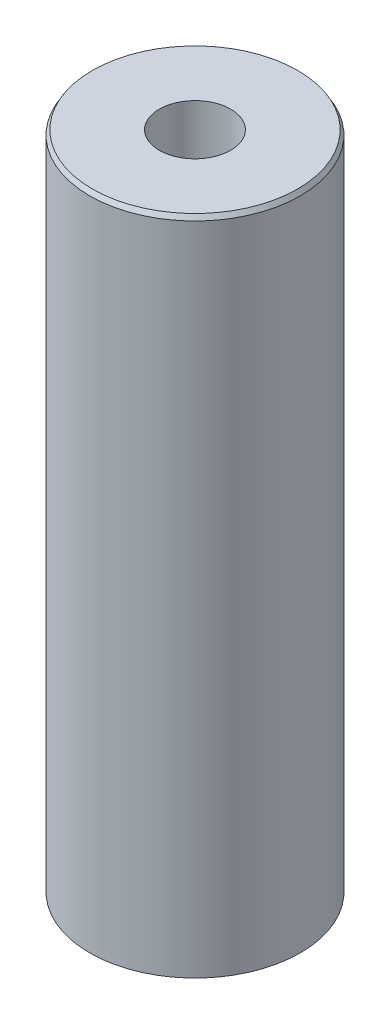
ISO-10303-21;
HEADER;
FILE_DESCRIPTION(('STEP AP214'),'2;1');
FILE_NAME('part.step','',(''),(''),'','','');
FILE_SCHEMA(('AUTOMOTIVE_DESIGN { 1 0 10303 214 1 1 1 1 }'));
ENDSEC;
DATA;
#1=APPLICATION_CONTEXT('core data for automotive mechanical design processes');
#2=APPLICATION_PROTOCOL_DEFINITION('international standard','automotive_design',2000,#1);
#3=PRODUCT_CONTEXT('',#1,'mechanical');
#4=PRODUCT('Part','Part','',(#3));
#5=PRODUCT_RELATED_PRODUCT_CATEGORY('part','',(#4));
#6=PRODUCT_DEFINITION_FORMATION('','',#4);
#7=PRODUCT_DEFINITION_CONTEXT('part definition',#1,'design');
#8=PRODUCT_DEFINITION('design','',#6,#7);
#9=PRODUCT_DEFINITION_SHAPE('','',#8);
#10=(LENGTH_UNIT() NAMED_UNIT(*) SI_UNIT(.MILLI.,.METRE.));
#11=(NAMED_UNIT(*) PLANE_ANGLE_UNIT() SI_UNIT($,.RADIAN.));
#12=(NAMED_UNIT(*) SI_UNIT($,.STERADIAN.) SOLID_ANGLE_UNIT());
#13=UNCERTAINTY_MEASURE_WITH_UNIT(LENGTH_MEASURE(1.E-05),#10,'distance_accuracy_value','');
#14=(GEOMETRIC_REPRESENTATION_CONTEXT(3) GLOBAL_UNCERTAINTY_ASSIGNED_CONTEXT((#13)) GLOBAL_UNIT_ASSIGNED_CONTEXT((#10,
#11,#12)) REPRESENTATION_CONTEXT('',''));
#15=CARTESIAN_POINT('',(0.,0.,0.));
#16=DIRECTION('',(0.,0.,1.));
#17=DIRECTION('',(1.,0.,0.));
#18=AXIS2_PLACEMENT_3D('',#15,#16,#17);
#19=CARTESIAN_POINT('',(0.,361.898156726558,0.));
#20=DIRECTION('',(0.,-1.,0.));
#21=DIRECTION('',(0.,0.,-1.));
#22=AXIS2_PLACEMENT_3D('',#19,#20,#21);
#23=CYLINDRICAL_SURFACE('',#22,57.5);
#24=CARTESIAN_POINT('',(0.,359.374535857106,0.));
#25=DIRECTION('',(0.,1.,0.));
#26=DIRECTION('',(0.,0.,1.));
#27=AXIS2_PLACEMENT_3D('',#24,#25,#26);
#28=CIRCLE('',#27,57.5);
#29=CARTESIAN_POINT('',(0.,359.374535857106,57.5));
#30=VERTEX_POINT('',#29);
#31=EDGE_CURVE('E50',#30,#30,#28,.F.);
#32=ORIENTED_EDGE('',*,*,#31,.T.);
#33=EDGE_LOOP('',(#32));
#34=FACE_BOUND('',#33,.T.);
#35=CARTESIAN_POINT('',(0.,1.45701318831054,0.));
#36=DIRECTION('',(0.,1.,0.));
#37=DIRECTION('',(0.,0.,1.));
#38=AXIS2_PLACEMENT_3D('',#35,#36,#37);
#39=CIRCLE('',#38,57.5);
#40=CARTESIAN_POINT('',(0.,1.45701318831054,57.5));
#41=VERTEX_POINT('',#40);
#42=EDGE_CURVE('E51',#41,#41,#39,.T.);
#43=ORIENTED_EDGE('',*,*,#42,.T.);
#44=EDGE_LOOP('',(#43));
#45=FACE_BOUND('',#44,.T.);
#46=ADVANCED_FACE('F39',(#34,#45),#23,.T.);
#47=CARTESIAN_POINT('',(0.,361.898156726558,0.));
#48=DIRECTION('',(0.,1.,0.));
#49=DIRECTION('',(0.,0.,1.));
#50=AXIS2_PLACEMENT_3D('',#47,#48,#49);
#51=PLANE('',#50);
#52=CARTESIAN_POINT('',(0.,361.898156726558,0.));
#53=DIRECTION('',(0.,1.,0.));
#54=DIRECTION('',(0.,0.,1.));
#55=AXIS2_PLACEMENT_3D('',#52,#53,#54);
#56=CIRCLE('',#55,56.0429868116894);
#57=CARTESIAN_POINT('',(0.,361.898156726558,56.0429868116894));
#58=VERTEX_POINT('',#57);
#59=EDGE_CURVE('E54',#58,#58,#56,.T.);
#60=ORIENTED_EDGE('',*,*,#59,.T.);
#61=EDGE_LOOP('',(#60));
#62=FACE_BOUND('',#61,.T.);
#63=CARTESIAN_POINT('',(0.,361.898156726558,0.));
#64=DIRECTION('',(0.,1.,0.));
#65=DIRECTION('',(0.,0.,1.));
#66=AXIS2_PLACEMENT_3D('',#63,#64,#65);
#67=CIRCLE('',#66,19.4806968060877);
#68=CARTESIAN_POINT('',(0.,361.898156726558,19.4806968060877));
#69=VERTEX_POINT('',#68);
#70=EDGE_CURVE('E58',#69,#69,#67,.T.);
#71=ORIENTED_EDGE('',*,*,#70,.F.);
#72=EDGE_LOOP('',(#71));
#73=FACE_BOUND('',#72,.T.);
#74=ADVANCED_FACE('F69',(#62,#73),#51,.T.);
#75=CARTESIAN_POINT('',(0.,0.,0.));
#76=DIRECTION('',(0.,1.,0.));
#77=DIRECTION('',(0.,0.,1.));
#78=AXIS2_PLACEMENT_3D('',#75,#76,#77);
#79=PLANE('',#78);
#80=CARTESIAN_POINT('',(0.,0.,0.));
#81=DIRECTION('',(0.,1.,0.));
#82=DIRECTION('',(0.,0.,1.));
#83=AXIS2_PLACEMENT_3D('',#80,#81,#82);
#84=CIRCLE('',#83,54.9763791305482);
#85=CARTESIAN_POINT('',(0.,0.,54.9763791305482));
#86=VERTEX_POINT('',#85);
#87=EDGE_CURVE('E10',#86,#86,#84,.F.);
#88=ORIENTED_EDGE('',*,*,#87,.T.);
#89=EDGE_LOOP('',(#88));
#90=FACE_BOUND('',#89,.T.);
#91=CARTESIAN_POINT('',(0.,0.,0.));
#92=DIRECTION('',(0.,1.,0.));
#93=DIRECTION('',(0.,0.,1.));
#94=AXIS2_PLACEMENT_3D('',#91,#92,#93);
#95=CIRCLE('',#94,19.4806968060877);
#96=CARTESIAN_POINT('',(0.,0.,19.4806968060877));
#97=VERTEX_POINT('',#96);
#98=EDGE_CURVE('E63',#97,#97,#95,.T.);
#99=ORIENTED_EDGE('',*,*,#98,.T.);
#100=EDGE_LOOP('',(#99));
#101=FACE_BOUND('',#100,.T.);
#102=ADVANCED_FACE('F75',(#90,#101),#79,.F.);
#103=CARTESIAN_POINT('',(0.,361.898156726558,0.));
#104=DIRECTION('',(0.,-1.,0.));
#105=DIRECTION('',(0.,0.,-1.));
#106=AXIS2_PLACEMENT_3D('',#103,#104,#105);
#107=CYLINDRICAL_SURFACE('',#106,19.4806968060877);
#108=ORIENTED_EDGE('',*,*,#70,.T.);
#109=EDGE_LOOP('',(#108));
#110=FACE_BOUND('',#109,.T.);
#111=ORIENTED_EDGE('',*,*,#98,.F.);
#112=EDGE_LOOP('',(#111));
#113=FACE_BOUND('',#112,.T.);
#114=ADVANCED_FACE('F70',(#110,#113),#107,.F.);
#115=CARTESIAN_POINT('',(0.,361.898156726558,0.));
#116=DIRECTION('',(0.,-1.,0.));
#117=DIRECTION('',(0.,0.,-1.));
#118=AXIS2_PLACEMENT_3D('',#115,#116,#117);
#119=CONICAL_SURFACE('',#118,56.0429868116894,0.523598775598307);
#120=ORIENTED_EDGE('',*,*,#31,.F.);
#121=EDGE_LOOP('',(#120));
#122=FACE_BOUND('',#121,.T.);
#123=ORIENTED_EDGE('',*,*,#59,.F.);
#124=EDGE_LOOP('',(#123));
#125=FACE_BOUND('',#124,.T.);
#126=ADVANCED_FACE('F81',(#122,#125),#119,.T.);
#127=CARTESIAN_POINT('',(0.,1.45701318831054,0.));
#128=DIRECTION('',(0.,1.,0.));
#129=DIRECTION('',(0.,0.,1.));
#130=AXIS2_PLACEMENT_3D('',#127,#128,#129);
#131=CONICAL_SURFACE('',#130,57.5,1.0471975511966);
#132=ORIENTED_EDGE('',*,*,#87,.F.);
#133=EDGE_LOOP('',(#132));
#134=FACE_BOUND('',#133,.T.);
#135=ORIENTED_EDGE('',*,*,#42,.F.);
#136=EDGE_LOOP('',(#135));
#137=FACE_BOUND('',#136,.T.);
#138=ADVANCED_FACE('F45',(#134,#137),#131,.T.);
#139=CLOSED_SHELL('',(#46,#74,#102,#114,#126,#138));
#140=MANIFOLD_SOLID_BREP('B2',#139);
#141=ADVANCED_BREP_SHAPE_REPRESENTATION('',(#18,#140),#14);
#142=SHAPE_DEFINITION_REPRESENTATION(#9,#141);
ENDSEC;
END-ISO-10303-21;
